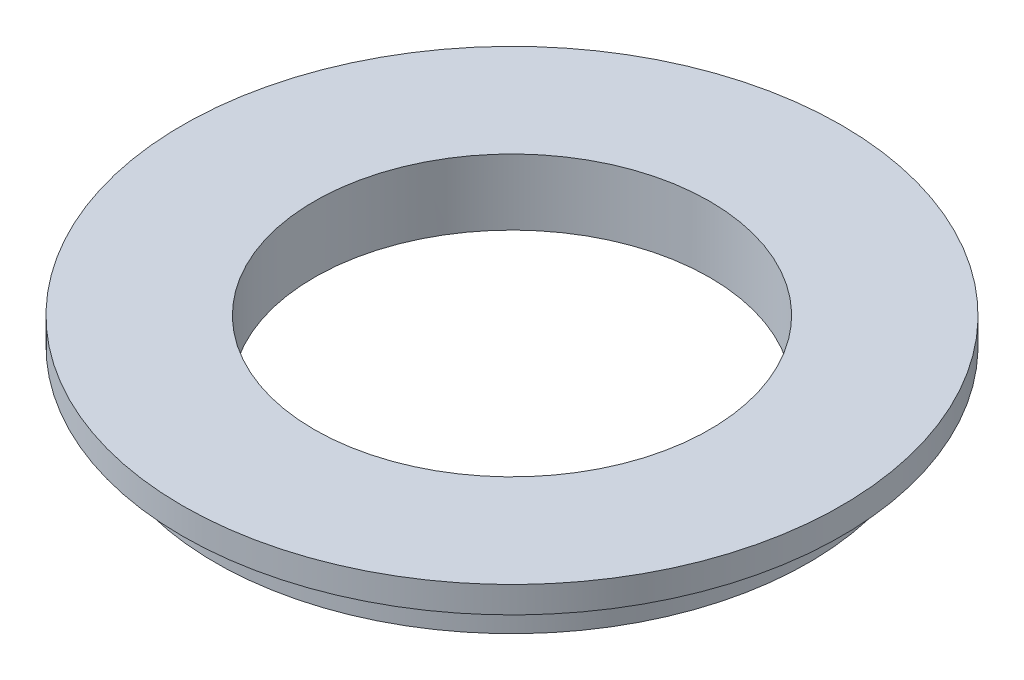
ISO-10303-21;
HEADER;
FILE_DESCRIPTION(('STEP AP214'),'2;1');
FILE_NAME('part.step','',(''),(''),'','','');
FILE_SCHEMA(('AUTOMOTIVE_DESIGN { 1 0 10303 214 1 1 1 1 }'));
ENDSEC;
DATA;
#1=APPLICATION_CONTEXT('core data for automotive mechanical design processes');
#2=APPLICATION_PROTOCOL_DEFINITION('international standard','automotive_design',2000,#1);
#3=PRODUCT_CONTEXT('',#1,'mechanical');
#4=PRODUCT('Part','Part','',(#3));
#5=PRODUCT_RELATED_PRODUCT_CATEGORY('part','',(#4));
#6=PRODUCT_DEFINITION_FORMATION('','',#4);
#7=PRODUCT_DEFINITION_CONTEXT('part definition',#1,'design');
#8=PRODUCT_DEFINITION('design','',#6,#7);
#9=PRODUCT_DEFINITION_SHAPE('','',#8);
#10=(LENGTH_UNIT() NAMED_UNIT(*) SI_UNIT(.MILLI.,.METRE.));
#11=(NAMED_UNIT(*) PLANE_ANGLE_UNIT() SI_UNIT($,.RADIAN.));
#12=(NAMED_UNIT(*) SI_UNIT($,.STERADIAN.) SOLID_ANGLE_UNIT());
#13=UNCERTAINTY_MEASURE_WITH_UNIT(LENGTH_MEASURE(1.E-05),#10,'distance_accuracy_value','');
#14=(GEOMETRIC_REPRESENTATION_CONTEXT(3) GLOBAL_UNCERTAINTY_ASSIGNED_CONTEXT((#13)) GLOBAL_UNIT_ASSIGNED_CONTEXT((#10,
#11,#12)) REPRESENTATION_CONTEXT('',''));
#15=CARTESIAN_POINT('',(0.,0.,0.));
#16=DIRECTION('',(0.,0.,1.));
#17=DIRECTION('',(1.,0.,0.));
#18=AXIS2_PLACEMENT_3D('',#15,#16,#17);
#19=CARTESIAN_POINT('',(0.,2.,0.));
#20=DIRECTION('',(0.,1.,0.));
#21=DIRECTION('',(0.,0.,1.));
#22=AXIS2_PLACEMENT_3D('',#19,#20,#21);
#23=PLANE('',#22);
#24=CARTESIAN_POINT('',(0.,2.,0.));
#25=DIRECTION('',(0.,1.,0.));
#26=DIRECTION('',(0.,0.,1.));
#27=AXIS2_PLACEMENT_3D('',#24,#25,#26);
#28=CIRCLE('',#27,25.);
#29=CARTESIAN_POINT('',(0.,2.,25.));
#30=VERTEX_POINT('',#29);
#31=EDGE_CURVE('E46',#30,#30,#28,.T.);
#32=ORIENTED_EDGE('',*,*,#31,.T.);
#33=EDGE_LOOP('',(#32));
#34=FACE_BOUND('',#33,.T.);
#35=CARTESIAN_POINT('',(0.,2.,0.));
#36=DIRECTION('',(0.,1.,0.));
#37=DIRECTION('',(0.,0.,1.));
#38=AXIS2_PLACEMENT_3D('',#35,#36,#37);
#39=CIRCLE('',#38,15.);
#40=CARTESIAN_POINT('',(0.,2.,15.));
#41=VERTEX_POINT('',#40);
#42=EDGE_CURVE('E56',#41,#41,#39,.T.);
#43=ORIENTED_EDGE('',*,*,#42,.F.);
#44=EDGE_LOOP('',(#43));
#45=FACE_BOUND('',#44,.T.);
#46=ADVANCED_FACE('F37',(#34,#45),#23,.T.);
#47=CARTESIAN_POINT('',(0.,0.,0.));
#48=DIRECTION('',(0.,1.,0.));
#49=DIRECTION('',(0.,0.,1.));
#50=AXIS2_PLACEMENT_3D('',#47,#48,#49);
#51=PLANE('',#50);
#52=CARTESIAN_POINT('',(0.,0.,0.));
#53=DIRECTION('',(0.,-1.,0.));
#54=DIRECTION('',(0.,0.,-1.));
#55=AXIS2_PLACEMENT_3D('',#52,#53,#54);
#56=CIRCLE('',#55,22.5);
#57=CARTESIAN_POINT('',(0.,0.,-22.5));
#58=VERTEX_POINT('',#57);
#59=EDGE_CURVE('E10',#58,#58,#56,.T.);
#60=ORIENTED_EDGE('',*,*,#59,.F.);
#61=EDGE_LOOP('',(#60));
#62=FACE_BOUND('',#61,.T.);
#63=CARTESIAN_POINT('',(0.,0.,0.));
#64=DIRECTION('',(0.,1.,0.));
#65=DIRECTION('',(0.,0.,1.));
#66=AXIS2_PLACEMENT_3D('',#63,#64,#65);
#67=CIRCLE('',#66,25.);
#68=CARTESIAN_POINT('',(0.,0.,25.));
#69=VERTEX_POINT('',#68);
#70=EDGE_CURVE('E41',#69,#69,#67,.T.);
#71=ORIENTED_EDGE('',*,*,#70,.F.);
#72=EDGE_LOOP('',(#71));
#73=FACE_BOUND('',#72,.T.);
#74=ADVANCED_FACE('F86',(#62,#73),#51,.F.);
#75=CARTESIAN_POINT('',(0.,2.,0.));
#76=DIRECTION('',(0.,-1.,0.));
#77=DIRECTION('',(0.,0.,-1.));
#78=AXIS2_PLACEMENT_3D('',#75,#76,#77);
#79=CYLINDRICAL_SURFACE('',#78,25.);
#80=ORIENTED_EDGE('',*,*,#31,.F.);
#81=EDGE_LOOP('',(#80));
#82=FACE_BOUND('',#81,.T.);
#83=ORIENTED_EDGE('',*,*,#70,.T.);
#84=EDGE_LOOP('',(#83));
#85=FACE_BOUND('',#84,.T.);
#86=ADVANCED_FACE('F39',(#82,#85),#79,.T.);
#87=CARTESIAN_POINT('',(0.,2.,0.));
#88=DIRECTION('',(0.,-1.,0.));
#89=DIRECTION('',(0.,0.,-1.));
#90=AXIS2_PLACEMENT_3D('',#87,#88,#89);
#91=CYLINDRICAL_SURFACE('',#90,15.);
#92=ORIENTED_EDGE('',*,*,#42,.T.);
#93=EDGE_LOOP('',(#92));
#94=FACE_BOUND('',#93,.T.);
#95=CARTESIAN_POINT('',(0.,-3.,0.));
#96=DIRECTION('',(0.,-1.,0.));
#97=DIRECTION('',(0.,0.,-1.));
#98=AXIS2_PLACEMENT_3D('',#95,#96,#97);
#99=CIRCLE('',#98,15.);
#100=CARTESIAN_POINT('',(0.,-3.,-15.));
#101=VERTEX_POINT('',#100);
#102=EDGE_CURVE('E65',#101,#101,#99,.T.);
#103=ORIENTED_EDGE('',*,*,#102,.T.);
#104=EDGE_LOOP('',(#103));
#105=FACE_BOUND('',#104,.T.);
#106=ADVANCED_FACE('F72',(#94,#105),#91,.F.);
#107=CARTESIAN_POINT('',(0.,-3.,0.));
#108=DIRECTION('',(0.,-1.,0.));
#109=DIRECTION('',(0.,0.,-1.));
#110=AXIS2_PLACEMENT_3D('',#107,#108,#109);
#111=PLANE('',#110);
#112=CARTESIAN_POINT('',(0.,-3.,0.));
#113=DIRECTION('',(0.,-1.,0.));
#114=DIRECTION('',(0.,0.,-1.));
#115=AXIS2_PLACEMENT_3D('',#112,#113,#114);
#116=CIRCLE('',#115,22.5);
#117=CARTESIAN_POINT('',(0.,-3.,-22.5));
#118=VERTEX_POINT('',#117);
#119=EDGE_CURVE('E54',#118,#118,#116,.T.);
#120=ORIENTED_EDGE('',*,*,#119,.T.);
#121=EDGE_LOOP('',(#120));
#122=FACE_BOUND('',#121,.T.);
#123=ORIENTED_EDGE('',*,*,#102,.F.);
#124=EDGE_LOOP('',(#123));
#125=FACE_BOUND('',#124,.T.);
#126=ADVANCED_FACE('F74',(#122,#125),#111,.T.);
#127=CARTESIAN_POINT('',(0.,-3.,0.));
#128=DIRECTION('',(0.,1.,0.));
#129=DIRECTION('',(0.,0.,1.));
#130=AXIS2_PLACEMENT_3D('',#127,#128,#129);
#131=CYLINDRICAL_SURFACE('',#130,22.5);
#132=ORIENTED_EDGE('',*,*,#119,.F.);
#133=EDGE_LOOP('',(#132));
#134=FACE_BOUND('',#133,.T.);
#135=ORIENTED_EDGE('',*,*,#59,.T.);
#136=EDGE_LOOP('',(#135));
#137=FACE_BOUND('',#136,.T.);
#138=ADVANCED_FACE('F76',(#134,#137),#131,.T.);
#139=CLOSED_SHELL('',(#46,#74,#86,#106,#126,#138));
#140=MANIFOLD_SOLID_BREP('B2',#139);
#141=ADVANCED_BREP_SHAPE_REPRESENTATION('',(#18,#140),#14);
#142=SHAPE_DEFINITION_REPRESENTATION(#9,#141);
ENDSEC;
END-ISO-10303-21;
